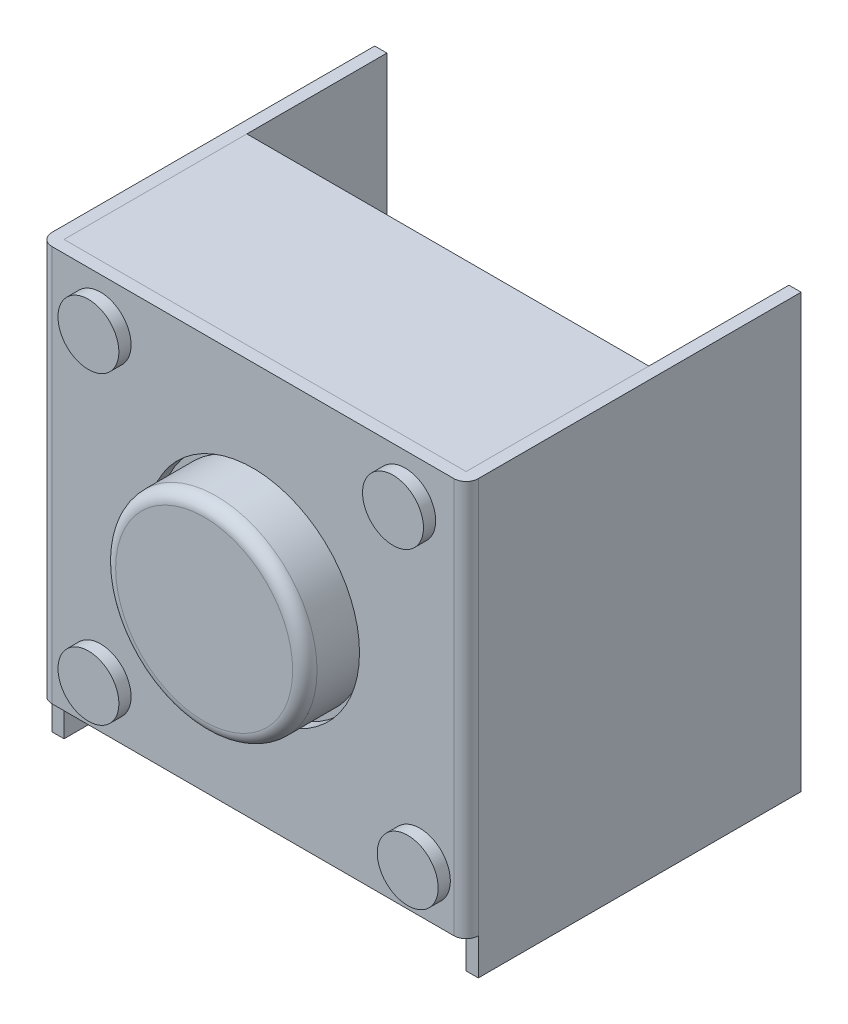
ISO-10303-21;
HEADER;
FILE_DESCRIPTION(('STEP AP214'),'2;1');
FILE_NAME('part.step','',(''),(''),'','','');
FILE_SCHEMA(('AUTOMOTIVE_DESIGN { 1 0 10303 214 1 1 1 1 }'));
ENDSEC;
DATA;
#1=APPLICATION_CONTEXT('core data for automotive mechanical design processes');
#2=APPLICATION_PROTOCOL_DEFINITION('international standard','automotive_design',2000,#1);
#3=PRODUCT_CONTEXT('',#1,'mechanical');
#4=PRODUCT('Part','Part','',(#3));
#5=PRODUCT_RELATED_PRODUCT_CATEGORY('part','',(#4));
#6=PRODUCT_DEFINITION_FORMATION('','',#4);
#7=PRODUCT_DEFINITION_CONTEXT('part definition',#1,'design');
#8=PRODUCT_DEFINITION('design','',#6,#7);
#9=PRODUCT_DEFINITION_SHAPE('','',#8);
#10=(LENGTH_UNIT() NAMED_UNIT(*) SI_UNIT(.MILLI.,.METRE.));
#11=(NAMED_UNIT(*) PLANE_ANGLE_UNIT() SI_UNIT($,.RADIAN.));
#12=(NAMED_UNIT(*) SI_UNIT($,.STERADIAN.) SOLID_ANGLE_UNIT());
#13=UNCERTAINTY_MEASURE_WITH_UNIT(LENGTH_MEASURE(1.E-05),#10,'distance_accuracy_value','');
#14=(GEOMETRIC_REPRESENTATION_CONTEXT(3) GLOBAL_UNCERTAINTY_ASSIGNED_CONTEXT((#13)) GLOBAL_UNIT_ASSIGNED_CONTEXT((#10,
#11,#12)) REPRESENTATION_CONTEXT('',''));
#15=CARTESIAN_POINT('',(0.,0.,0.));
#16=DIRECTION('',(0.,0.,1.));
#17=DIRECTION('',(1.,0.,0.));
#18=AXIS2_PLACEMENT_3D('',#15,#16,#17);
#19=CARTESIAN_POINT('',(2.74143456892354,-2.5,0.4));
#20=DIRECTION('',(0.,0.,-1.));
#21=DIRECTION('',(-1.,0.,0.));
#22=AXIS2_PLACEMENT_3D('',#19,#20,#21);
#23=CYLINDRICAL_SURFACE('',#22,0.5);
#24=CARTESIAN_POINT('',(2.74143456892354,-2.5,0.4));
#25=DIRECTION('',(0.,0.,1.));
#26=DIRECTION('',(1.,0.,0.));
#27=AXIS2_PLACEMENT_3D('',#24,#25,#26);
#28=CIRCLE('',#27,0.5);
#29=CARTESIAN_POINT('',(3.24143456892354,-2.5,0.4));
#30=VERTEX_POINT('',#29);
#31=EDGE_CURVE('E11',#30,#30,#28,.T.);
#32=ORIENTED_EDGE('',*,*,#31,.F.);
#33=EDGE_LOOP('',(#32));
#34=FACE_BOUND('',#33,.T.);
#35=CARTESIAN_POINT('',(2.74143456892354,-2.5,0.));
#36=DIRECTION('',(0.,0.,1.));
#37=DIRECTION('',(1.,0.,0.));
#38=AXIS2_PLACEMENT_3D('',#35,#36,#37);
#39=CIRCLE('',#38,0.5);
#40=CARTESIAN_POINT('',(3.24143456892354,-2.5,0.));
#41=VERTEX_POINT('',#40);
#42=EDGE_CURVE('E47',#41,#41,#39,.T.);
#43=ORIENTED_EDGE('',*,*,#42,.T.);
#44=EDGE_LOOP('',(#43));
#45=FACE_BOUND('',#44,.T.);
#46=ADVANCED_FACE('F44',(#34,#45),#23,.T.);
#47=CARTESIAN_POINT('',(2.74143456892354,-2.5,0.4));
#48=DIRECTION('',(0.,0.,1.));
#49=DIRECTION('',(1.,0.,0.));
#50=AXIS2_PLACEMENT_3D('',#47,#48,#49);
#51=PLANE('',#50);
#52=ORIENTED_EDGE('',*,*,#31,.T.);
#53=EDGE_LOOP('',(#52));
#54=FACE_BOUND('',#53,.T.);
#55=ADVANCED_FACE('F59',(#54),#51,.T.);
#56=CARTESIAN_POINT('',(2.74143456892354,-2.5,0.));
#57=DIRECTION('',(0.,0.,1.));
#58=DIRECTION('',(1.,0.,0.));
#59=AXIS2_PLACEMENT_3D('',#56,#57,#58);
#60=PLANE('',#59);
#61=ORIENTED_EDGE('',*,*,#42,.F.);
#62=EDGE_LOOP('',(#61));
#63=FACE_BOUND('',#62,.T.);
#64=ADVANCED_FACE('F57',(#63),#60,.F.);
#65=CLOSED_SHELL('',(#46,#55,#64));
#66=MANIFOLD_SOLID_BREP('B2',#65);
#67=CARTESIAN_POINT('',(-2.5,-2.5,0.4));
#68=DIRECTION('',(0.,0.,-1.));
#69=DIRECTION('',(-1.,0.,0.));
#70=AXIS2_PLACEMENT_3D('',#67,#68,#69);
#71=CYLINDRICAL_SURFACE('',#70,0.5);
#72=CARTESIAN_POINT('',(-2.5,-2.5,0.4));
#73=DIRECTION('',(0.,0.,1.));
#74=DIRECTION('',(1.,0.,0.));
#75=AXIS2_PLACEMENT_3D('',#72,#73,#74);
#76=CIRCLE('',#75,0.5);
#77=CARTESIAN_POINT('',(-2.,-2.5,0.4));
#78=VERTEX_POINT('',#77);
#79=EDGE_CURVE('E43',#78,#78,#76,.T.);
#80=ORIENTED_EDGE('',*,*,#79,.F.);
#81=EDGE_LOOP('',(#80));
#82=FACE_BOUND('',#81,.T.);
#83=CARTESIAN_POINT('',(-2.5,-2.5,0.));
#84=DIRECTION('',(0.,0.,1.));
#85=DIRECTION('',(1.,0.,0.));
#86=AXIS2_PLACEMENT_3D('',#83,#84,#85);
#87=CIRCLE('',#86,0.5);
#88=CARTESIAN_POINT('',(-2.,-2.5,0.));
#89=VERTEX_POINT('',#88);
#90=EDGE_CURVE('E96',#89,#89,#87,.T.);
#91=ORIENTED_EDGE('',*,*,#90,.T.);
#92=EDGE_LOOP('',(#91));
#93=FACE_BOUND('',#92,.T.);
#94=ADVANCED_FACE('F93',(#82,#93),#71,.T.);
#95=CARTESIAN_POINT('',(-2.5,-2.5,0.4));
#96=DIRECTION('',(0.,0.,1.));
#97=DIRECTION('',(1.,0.,0.));
#98=AXIS2_PLACEMENT_3D('',#95,#96,#97);
#99=PLANE('',#98);
#100=ORIENTED_EDGE('',*,*,#79,.T.);
#101=EDGE_LOOP('',(#100));
#102=FACE_BOUND('',#101,.T.);
#103=ADVANCED_FACE('F108',(#102),#99,.T.);
#104=CARTESIAN_POINT('',(-2.5,-2.5,0.));
#105=DIRECTION('',(0.,0.,1.));
#106=DIRECTION('',(1.,0.,0.));
#107=AXIS2_PLACEMENT_3D('',#104,#105,#106);
#108=PLANE('',#107);
#109=ORIENTED_EDGE('',*,*,#90,.F.);
#110=EDGE_LOOP('',(#109));
#111=FACE_BOUND('',#110,.T.);
#112=ADVANCED_FACE('F106',(#111),#108,.F.);
#113=CLOSED_SHELL('',(#94,#103,#112));
#114=MANIFOLD_SOLID_BREP('B6',#113);
#115=CARTESIAN_POINT('',(-2.5,2.5,0.4));
#116=DIRECTION('',(0.,0.,-1.));
#117=DIRECTION('',(-1.,0.,0.));
#118=AXIS2_PLACEMENT_3D('',#115,#116,#117);
#119=CYLINDRICAL_SURFACE('',#118,0.5);
#120=CARTESIAN_POINT('',(-2.5,2.5,0.4));
#121=DIRECTION('',(0.,0.,1.));
#122=DIRECTION('',(1.,0.,0.));
#123=AXIS2_PLACEMENT_3D('',#120,#121,#122);
#124=CIRCLE('',#123,0.5);
#125=CARTESIAN_POINT('',(-2.,2.5,0.4));
#126=VERTEX_POINT('',#125);
#127=EDGE_CURVE('E92',#126,#126,#124,.T.);
#128=ORIENTED_EDGE('',*,*,#127,.F.);
#129=EDGE_LOOP('',(#128));
#130=FACE_BOUND('',#129,.T.);
#131=CARTESIAN_POINT('',(-2.5,2.5,0.));
#132=DIRECTION('',(0.,0.,1.));
#133=DIRECTION('',(1.,0.,0.));
#134=AXIS2_PLACEMENT_3D('',#131,#132,#133);
#135=CIRCLE('',#134,0.5);
#136=CARTESIAN_POINT('',(-2.,2.5,0.));
#137=VERTEX_POINT('',#136);
#138=EDGE_CURVE('E145',#137,#137,#135,.T.);
#139=ORIENTED_EDGE('',*,*,#138,.T.);
#140=EDGE_LOOP('',(#139));
#141=FACE_BOUND('',#140,.T.);
#142=ADVANCED_FACE('F142',(#130,#141),#119,.T.);
#143=CARTESIAN_POINT('',(-2.5,2.5,0.4));
#144=DIRECTION('',(0.,0.,1.));
#145=DIRECTION('',(1.,0.,0.));
#146=AXIS2_PLACEMENT_3D('',#143,#144,#145);
#147=PLANE('',#146);
#148=ORIENTED_EDGE('',*,*,#127,.T.);
#149=EDGE_LOOP('',(#148));
#150=FACE_BOUND('',#149,.T.);
#151=ADVANCED_FACE('F157',(#150),#147,.T.);
#152=CARTESIAN_POINT('',(-2.5,2.5,0.));
#153=DIRECTION('',(0.,0.,1.));
#154=DIRECTION('',(1.,0.,0.));
#155=AXIS2_PLACEMENT_3D('',#152,#153,#154);
#156=PLANE('',#155);
#157=ORIENTED_EDGE('',*,*,#138,.F.);
#158=EDGE_LOOP('',(#157));
#159=FACE_BOUND('',#158,.T.);
#160=ADVANCED_FACE('F155',(#159),#156,.F.);
#161=CLOSED_SHELL('',(#142,#151,#160));
#162=MANIFOLD_SOLID_BREP('B38',#161);
#163=CARTESIAN_POINT('',(2.5,2.5,0.4));
#164=DIRECTION('',(0.,0.,-1.));
#165=DIRECTION('',(-1.,0.,0.));
#166=AXIS2_PLACEMENT_3D('',#163,#164,#165);
#167=CYLINDRICAL_SURFACE('',#166,0.5);
#168=CARTESIAN_POINT('',(2.5,2.5,0.4));
#169=DIRECTION('',(0.,0.,1.));
#170=DIRECTION('',(1.,0.,0.));
#171=AXIS2_PLACEMENT_3D('',#168,#169,#170);
#172=CIRCLE('',#171,0.5);
#173=CARTESIAN_POINT('',(3.,2.5,0.4));
#174=VERTEX_POINT('',#173);
#175=EDGE_CURVE('E141',#174,#174,#172,.T.);
#176=ORIENTED_EDGE('',*,*,#175,.F.);
#177=EDGE_LOOP('',(#176));
#178=FACE_BOUND('',#177,.T.);
#179=CARTESIAN_POINT('',(2.5,2.5,0.));
#180=DIRECTION('',(0.,0.,1.));
#181=DIRECTION('',(1.,0.,0.));
#182=AXIS2_PLACEMENT_3D('',#179,#180,#181);
#183=CIRCLE('',#182,0.5);
#184=CARTESIAN_POINT('',(3.,2.5,0.));
#185=VERTEX_POINT('',#184);
#186=EDGE_CURVE('E194',#185,#185,#183,.T.);
#187=ORIENTED_EDGE('',*,*,#186,.T.);
#188=EDGE_LOOP('',(#187));
#189=FACE_BOUND('',#188,.T.);
#190=ADVANCED_FACE('F191',(#178,#189),#167,.T.);
#191=CARTESIAN_POINT('',(2.5,2.5,0.4));
#192=DIRECTION('',(0.,0.,1.));
#193=DIRECTION('',(1.,0.,0.));
#194=AXIS2_PLACEMENT_3D('',#191,#192,#193);
#195=PLANE('',#194);
#196=ORIENTED_EDGE('',*,*,#175,.T.);
#197=EDGE_LOOP('',(#196));
#198=FACE_BOUND('',#197,.T.);
#199=ADVANCED_FACE('F206',(#198),#195,.T.);
#200=CARTESIAN_POINT('',(2.5,2.5,0.));
#201=DIRECTION('',(0.,0.,1.));
#202=DIRECTION('',(1.,0.,0.));
#203=AXIS2_PLACEMENT_3D('',#200,#201,#202);
#204=PLANE('',#203);
#205=ORIENTED_EDGE('',*,*,#186,.F.);
#206=EDGE_LOOP('',(#205));
#207=FACE_BOUND('',#206,.T.);
#208=ADVANCED_FACE('F204',(#207),#204,.F.);
#209=CLOSED_SHELL('',(#190,#199,#208));
#210=MANIFOLD_SOLID_BREP('B87',#209);
#211=CARTESIAN_POINT('',(0.,0.,1.));
#212=DIRECTION('',(0.,0.,-1.));
#213=DIRECTION('',(-1.,0.,0.));
#214=AXIS2_PLACEMENT_3D('',#211,#212,#213);
#215=CYLINDRICAL_SURFACE('',#214,1.65282338303741);
#216=CARTESIAN_POINT('',(0.,0.,0.8));
#217=DIRECTION('',(0.,0.,1.));
#218=DIRECTION('',(1.,0.,0.));
#219=AXIS2_PLACEMENT_3D('',#216,#217,#218);
#220=CIRCLE('',#219,1.65282338303741);
#221=CARTESIAN_POINT('',(1.65282338303741,0.,0.8));
#222=VERTEX_POINT('',#221);
#223=EDGE_CURVE('E190',#222,#222,#220,.F.);
#224=ORIENTED_EDGE('',*,*,#223,.T.);
#225=EDGE_LOOP('',(#224));
#226=FACE_BOUND('',#225,.T.);
#227=CARTESIAN_POINT('',(0.,0.,0.));
#228=DIRECTION('',(0.,0.,1.));
#229=DIRECTION('',(1.,0.,0.));
#230=AXIS2_PLACEMENT_3D('',#227,#228,#229);
#231=CIRCLE('',#230,1.65282338303741);
#232=CARTESIAN_POINT('',(1.65282338303741,0.,0.));
#233=VERTEX_POINT('',#232);
#234=EDGE_CURVE('E253',#233,#233,#231,.T.);
#235=ORIENTED_EDGE('',*,*,#234,.T.);
#236=EDGE_LOOP('',(#235));
#237=FACE_BOUND('',#236,.T.);
#238=ADVANCED_FACE('F242',(#226,#237),#215,.T.);
#239=CARTESIAN_POINT('',(0.,0.,1.));
#240=DIRECTION('',(0.,0.,1.));
#241=DIRECTION('',(1.,0.,0.));
#242=AXIS2_PLACEMENT_3D('',#239,#240,#241);
#243=PLANE('',#242);
#244=CARTESIAN_POINT('',(0.,0.,1.));
#245=DIRECTION('',(0.,0.,1.));
#246=DIRECTION('',(1.,0.,0.));
#247=AXIS2_PLACEMENT_3D('',#244,#245,#246);
#248=CIRCLE('',#247,1.45282338303741);
#249=CARTESIAN_POINT('',(1.45282338303741,0.,1.));
#250=VERTEX_POINT('',#249);
#251=EDGE_CURVE('E249',#250,#250,#248,.T.);
#252=ORIENTED_EDGE('',*,*,#251,.T.);
#253=EDGE_LOOP('',(#252));
#254=FACE_BOUND('',#253,.T.);
#255=ADVANCED_FACE('F263',(#254),#243,.T.);
#256=CARTESIAN_POINT('',(0.,0.,0.));
#257=DIRECTION('',(0.,0.,1.));
#258=DIRECTION('',(1.,0.,0.));
#259=AXIS2_PLACEMENT_3D('',#256,#257,#258);
#260=PLANE('',#259);
#261=ORIENTED_EDGE('',*,*,#234,.F.);
#262=EDGE_LOOP('',(#261));
#263=FACE_BOUND('',#262,.T.);
#264=ADVANCED_FACE('F261',(#263),#260,.F.);
#265=CARTESIAN_POINT('',(0.,0.,0.8));
#266=DIRECTION('',(0.,0.,1.));
#267=DIRECTION('',(1.,0.,0.));
#268=AXIS2_PLACEMENT_3D('',#265,#266,#267);
#269=TOROIDAL_SURFACE('',#268,1.45282338303741,0.2);
#270=ORIENTED_EDGE('',*,*,#223,.F.);
#271=EDGE_LOOP('',(#270));
#272=FACE_BOUND('',#271,.T.);
#273=ORIENTED_EDGE('',*,*,#251,.F.);
#274=EDGE_LOOP('',(#273));
#275=FACE_BOUND('',#274,.T.);
#276=ADVANCED_FACE('F244',(#272,#275),#269,.T.);
#277=CLOSED_SHELL('',(#238,#255,#264,#276));
#278=MANIFOLD_SOLID_BREP('B136',#277);
#279=CARTESIAN_POINT('',(3.3,3.25,-3.));
#280=DIRECTION('',(-1.,0.,0.));
#281=DIRECTION('',(0.,0.,1.));
#282=AXIS2_PLACEMENT_3D('',#279,#280,#281);
#283=PLANE('',#282);
#284=DIRECTION('',(0.,-1.,0.));
#285=VECTOR('',#284,1.);
#286=CARTESIAN_POINT('',(3.3,3.25,0.));
#287=LINE('',#286,#285);
#288=CARTESIAN_POINT('',(3.3,3.25,0.));
#289=VERTEX_POINT('',#288);
#290=CARTESIAN_POINT('',(3.3,-3.25,0.));
#291=VERTEX_POINT('',#290);
#292=EDGE_CURVE('E370',#289,#291,#287,.T.);
#293=ORIENTED_EDGE('',*,*,#292,.T.);
#294=DIRECTION('',(0.,0.,1.));
#295=VECTOR('',#294,1.);
#296=CARTESIAN_POINT('',(3.3,-3.25,-3.));
#297=LINE('',#296,#295);
#298=CARTESIAN_POINT('',(3.3,-3.25,-3.));
#299=VERTEX_POINT('',#298);
#300=EDGE_CURVE('E240',#299,#291,#297,.T.);
#301=ORIENTED_EDGE('',*,*,#300,.F.);
#302=DIRECTION('',(0.,-1.,0.));
#303=VECTOR('',#302,1.);
#304=CARTESIAN_POINT('',(3.3,3.25,-3.));
#305=LINE('',#304,#303);
#306=CARTESIAN_POINT('',(3.3,3.25,-3.));
#307=VERTEX_POINT('',#306);
#308=EDGE_CURVE('E358',#307,#299,#305,.T.);
#309=ORIENTED_EDGE('',*,*,#308,.F.);
#310=DIRECTION('',(0.,0.,1.));
#311=VECTOR('',#310,1.);
#312=CARTESIAN_POINT('',(3.3,3.25,-3.));
#313=LINE('',#312,#311);
#314=EDGE_CURVE('E366',#307,#289,#313,.T.);
#315=ORIENTED_EDGE('',*,*,#314,.T.);
#316=EDGE_LOOP('',(#293,#301,#309,#315));
#317=FACE_BOUND('',#316,.T.);
#318=ADVANCED_FACE('F307',(#317),#283,.F.);
#319=CARTESIAN_POINT('',(3.3,-3.25,-3.));
#320=DIRECTION('',(0.,1.,0.));
#321=DIRECTION('',(0.,0.,1.));
#322=AXIS2_PLACEMENT_3D('',#319,#320,#321);
#323=PLANE('',#322);
#324=DIRECTION('',(-1.,0.,0.));
#325=VECTOR('',#324,1.);
#326=CARTESIAN_POINT('',(3.3,-3.25,0.));
#327=LINE('',#326,#325);
#328=CARTESIAN_POINT('',(-3.3,-3.25,0.));
#329=VERTEX_POINT('',#328);
#330=EDGE_CURVE('E362',#291,#329,#327,.T.);
#331=ORIENTED_EDGE('',*,*,#330,.T.);
#332=DIRECTION('',(0.,0.,1.));
#333=VECTOR('',#332,1.);
#334=CARTESIAN_POINT('',(-3.3,-3.25,-3.));
#335=LINE('',#334,#333);
#336=CARTESIAN_POINT('',(-3.3,-3.25,-3.));
#337=VERTEX_POINT('',#336);
#338=EDGE_CURVE('E315',#337,#329,#335,.T.);
#339=ORIENTED_EDGE('',*,*,#338,.F.);
#340=DIRECTION('',(-1.,0.,0.));
#341=VECTOR('',#340,1.);
#342=CARTESIAN_POINT('',(3.3,-3.25,-3.));
#343=LINE('',#342,#341);
#344=EDGE_CURVE('E353',#299,#337,#343,.T.);
#345=ORIENTED_EDGE('',*,*,#344,.F.);
#346=ORIENTED_EDGE('',*,*,#300,.T.);
#347=EDGE_LOOP('',(#331,#339,#345,#346));
#348=FACE_BOUND('',#347,.T.);
#349=ADVANCED_FACE('F361',(#348),#323,.F.);
#350=CARTESIAN_POINT('',(-3.3,3.25,-3.));
#351=DIRECTION('',(1.,0.,0.));
#352=DIRECTION('',(0.,1.,0.));
#353=AXIS2_PLACEMENT_3D('',#350,#351,#352);
#354=PLANE('',#353);
#355=DIRECTION('',(0.,1.,0.));
#356=VECTOR('',#355,1.);
#357=CARTESIAN_POINT('',(-3.3,3.25,0.));
#358=LINE('',#357,#356);
#359=CARTESIAN_POINT('',(-3.3,3.25,0.));
#360=VERTEX_POINT('',#359);
#361=EDGE_CURVE('E340',#329,#360,#358,.T.);
#362=ORIENTED_EDGE('',*,*,#361,.T.);
#363=DIRECTION('',(0.,0.,1.));
#364=VECTOR('',#363,1.);
#365=CARTESIAN_POINT('',(-3.3,3.25,-3.));
#366=LINE('',#365,#364);
#367=CARTESIAN_POINT('',(-3.3,3.25,-3.));
#368=VERTEX_POINT('',#367);
#369=EDGE_CURVE('E363',#368,#360,#366,.T.);
#370=ORIENTED_EDGE('',*,*,#369,.F.);
#371=DIRECTION('',(0.,1.,0.));
#372=VECTOR('',#371,1.);
#373=CARTESIAN_POINT('',(-3.3,3.25,-3.));
#374=LINE('',#373,#372);
#375=EDGE_CURVE('E356',#337,#368,#374,.T.);
#376=ORIENTED_EDGE('',*,*,#375,.F.);
#377=ORIENTED_EDGE('',*,*,#338,.T.);
#378=EDGE_LOOP('',(#362,#370,#376,#377));
#379=FACE_BOUND('',#378,.T.);
#380=ADVANCED_FACE('F364',(#379),#354,.F.);
#381=CARTESIAN_POINT('',(3.3,3.25,-3.));
#382=DIRECTION('',(0.,-1.,0.));
#383=DIRECTION('',(0.,0.,-1.));
#384=AXIS2_PLACEMENT_3D('',#381,#382,#383);
#385=PLANE('',#384);
#386=DIRECTION('',(1.,0.,0.));
#387=VECTOR('',#386,1.);
#388=CARTESIAN_POINT('',(3.3,3.25,0.));
#389=LINE('',#388,#387);
#390=EDGE_CURVE('E346',#360,#289,#389,.T.);
#391=ORIENTED_EDGE('',*,*,#390,.T.);
#392=ORIENTED_EDGE('',*,*,#314,.F.);
#393=DIRECTION('',(1.,0.,0.));
#394=VECTOR('',#393,1.);
#395=CARTESIAN_POINT('',(3.3,3.25,-3.));
#396=LINE('',#395,#394);
#397=EDGE_CURVE('E323',#368,#307,#396,.T.);
#398=ORIENTED_EDGE('',*,*,#397,.F.);
#399=ORIENTED_EDGE('',*,*,#369,.T.);
#400=EDGE_LOOP('',(#391,#392,#398,#399));
#401=FACE_BOUND('',#400,.T.);
#402=ADVANCED_FACE('F377',(#401),#385,.F.);
#403=CARTESIAN_POINT('',(3.3,-3.25,-3.));
#404=DIRECTION('',(0.,0.,-1.));
#405=DIRECTION('',(-1.,0.,0.));
#406=AXIS2_PLACEMENT_3D('',#403,#404,#405);
#407=PLANE('',#406);
#408=ORIENTED_EDGE('',*,*,#308,.T.);
#409=ORIENTED_EDGE('',*,*,#344,.T.);
#410=ORIENTED_EDGE('',*,*,#375,.T.);
#411=ORIENTED_EDGE('',*,*,#397,.T.);
#412=EDGE_LOOP('',(#408,#409,#410,#411));
#413=FACE_BOUND('',#412,.T.);
#414=ADVANCED_FACE('F354',(#413),#407,.T.);
#415=CARTESIAN_POINT('',(3.3,-3.25,0.));
#416=DIRECTION('',(0.,0.,-1.));
#417=DIRECTION('',(-1.,0.,0.));
#418=AXIS2_PLACEMENT_3D('',#415,#416,#417);
#419=PLANE('',#418);
#420=ORIENTED_EDGE('',*,*,#292,.F.);
#421=ORIENTED_EDGE('',*,*,#390,.F.);
#422=ORIENTED_EDGE('',*,*,#361,.F.);
#423=ORIENTED_EDGE('',*,*,#330,.F.);
#424=EDGE_LOOP('',(#420,#421,#422,#423));
#425=FACE_BOUND('',#424,.T.);
#426=ADVANCED_FACE('F380',(#425),#419,.F.);
#427=CLOSED_SHELL('',(#318,#349,#380,#402,#414,#426));
#428=MANIFOLD_SOLID_BREP('B185',#427);
#429=CARTESIAN_POINT('',(-3.5,3.25,0.2));
#430=DIRECTION('',(0.,0.,1.));
#431=DIRECTION('',(1.,0.,0.));
#432=AXIS2_PLACEMENT_3D('',#429,#430,#431);
#433=PLANE('',#432);
#434=DIRECTION('',(-1.,0.,0.));
#435=VECTOR('',#434,1.);
#436=CARTESIAN_POINT('',(-3.5,3.25,0.2));
#437=LINE('',#436,#435);
#438=CARTESIAN_POINT('',(3.3,3.25,0.2));
#439=VERTEX_POINT('',#438);
#440=CARTESIAN_POINT('',(-3.3,3.25,0.2));
#441=VERTEX_POINT('',#440);
#442=EDGE_CURVE('E628',#439,#441,#437,.T.);
#443=ORIENTED_EDGE('',*,*,#442,.T.);
#444=DIRECTION('',(0.,-1.,0.));
#445=VECTOR('',#444,1.);
#446=CARTESIAN_POINT('',(-3.3,-3.25,0.2));
#447=LINE('',#446,#445);
#448=CARTESIAN_POINT('',(-3.3,-3.25,0.2));
#449=VERTEX_POINT('',#448);
#450=EDGE_CURVE('E642',#441,#449,#447,.T.);
#451=ORIENTED_EDGE('',*,*,#450,.T.);
#452=DIRECTION('',(1.,0.,0.));
#453=VECTOR('',#452,1.);
#454=CARTESIAN_POINT('',(-3.5,-3.25,0.2));
#455=LINE('',#454,#453);
#456=CARTESIAN_POINT('',(3.3,-3.25,0.2));
#457=VERTEX_POINT('',#456);
#458=EDGE_CURVE('E625',#449,#457,#455,.T.);
#459=ORIENTED_EDGE('',*,*,#458,.T.);
#460=DIRECTION('',(0.,1.,0.));
#461=VECTOR('',#460,1.);
#462=CARTESIAN_POINT('',(3.3,3.25,0.2));
#463=LINE('',#462,#461);
#464=EDGE_CURVE('E639',#457,#439,#463,.T.);
#465=ORIENTED_EDGE('',*,*,#464,.T.);
#466=EDGE_LOOP('',(#443,#451,#459,#465));
#467=FACE_BOUND('',#466,.T.);
#468=CARTESIAN_POINT('',(-2.5,-2.5,0.2));
#469=DIRECTION('',(0.,0.,1.));
#470=DIRECTION('',(1.,0.,0.));
#471=AXIS2_PLACEMENT_3D('',#468,#469,#470);
#472=CIRCLE('',#471,0.5);
#473=CARTESIAN_POINT('',(-2.,-2.5,0.2));
#474=VERTEX_POINT('',#473);
#475=EDGE_CURVE('E601',#474,#474,#472,.T.);
#476=ORIENTED_EDGE('',*,*,#475,.F.);
#477=EDGE_LOOP('',(#476));
#478=FACE_BOUND('',#477,.T.);
#479=CARTESIAN_POINT('',(2.5,2.5,0.2));
#480=DIRECTION('',(0.,0.,1.));
#481=DIRECTION('',(1.,0.,0.));
#482=AXIS2_PLACEMENT_3D('',#479,#480,#481);
#483=CIRCLE('',#482,0.5);
#484=CARTESIAN_POINT('',(3.,2.5,0.2));
#485=VERTEX_POINT('',#484);
#486=EDGE_CURVE('E613',#485,#485,#483,.T.);
#487=ORIENTED_EDGE('',*,*,#486,.F.);
#488=EDGE_LOOP('',(#487));
#489=FACE_BOUND('',#488,.T.);
#490=CARTESIAN_POINT('',(0.,0.,0.2));
#491=DIRECTION('',(0.,0.,1.));
#492=DIRECTION('',(1.,0.,0.));
#493=AXIS2_PLACEMENT_3D('',#490,#491,#492);
#494=CIRCLE('',#493,1.75);
#495=CARTESIAN_POINT('',(1.75,0.,0.2));
#496=VERTEX_POINT('',#495);
#497=EDGE_CURVE('E619',#496,#496,#494,.T.);
#498=ORIENTED_EDGE('',*,*,#497,.F.);
#499=EDGE_LOOP('',(#498));
#500=FACE_BOUND('',#499,.T.);
#501=CARTESIAN_POINT('',(2.74143456892354,-2.5,0.2));
#502=DIRECTION('',(0.,0.,1.));
#503=DIRECTION('',(1.,0.,0.));
#504=AXIS2_PLACEMENT_3D('',#501,#502,#503);
#505=CIRCLE('',#504,0.5);
#506=CARTESIAN_POINT('',(3.24143456892354,-2.5,0.2));
#507=VERTEX_POINT('',#506);
#508=EDGE_CURVE('E607',#507,#507,#505,.T.);
#509=ORIENTED_EDGE('',*,*,#508,.F.);
#510=EDGE_LOOP('',(#509));
#511=FACE_BOUND('',#510,.T.);
#512=CARTESIAN_POINT('',(-2.5,2.5,0.2));
#513=DIRECTION('',(0.,0.,1.));
#514=DIRECTION('',(1.,0.,0.));
#515=AXIS2_PLACEMENT_3D('',#512,#513,#514);
#516=CIRCLE('',#515,0.5);
#517=CARTESIAN_POINT('',(-2.,2.5,0.2));
#518=VERTEX_POINT('',#517);
#519=EDGE_CURVE('E595',#518,#518,#516,.T.);
#520=ORIENTED_EDGE('',*,*,#519,.F.);
#521=EDGE_LOOP('',(#520));
#522=FACE_BOUND('',#521,.T.);
#523=ADVANCED_FACE('F431',(#467,#478,#489,#500,#511,#522),#433,.T.);
#524=CARTESIAN_POINT('',(-3.5,3.25,0.));
#525=DIRECTION('',(0.,0.,1.));
#526=DIRECTION('',(1.,0.,0.));
#527=AXIS2_PLACEMENT_3D('',#524,#525,#526);
#528=PLANE('',#527);
#529=CARTESIAN_POINT('',(-2.5,-2.5,0.));
#530=DIRECTION('',(0.,0.,1.));
#531=DIRECTION('',(1.,0.,0.));
#532=AXIS2_PLACEMENT_3D('',#529,#530,#531);
#533=CIRCLE('',#532,0.5);
#534=CARTESIAN_POINT('',(-2.,-2.5,0.));
#535=VERTEX_POINT('',#534);
#536=EDGE_CURVE('E598',#535,#535,#533,.T.);
#537=ORIENTED_EDGE('',*,*,#536,.T.);
#538=EDGE_LOOP('',(#537));
#539=FACE_BOUND('',#538,.T.);
#540=CARTESIAN_POINT('',(2.5,2.5,0.));
#541=DIRECTION('',(0.,0.,1.));
#542=DIRECTION('',(1.,0.,0.));
#543=AXIS2_PLACEMENT_3D('',#540,#541,#542);
#544=CIRCLE('',#543,0.5);
#545=CARTESIAN_POINT('',(3.,2.5,0.));
#546=VERTEX_POINT('',#545);
#547=EDGE_CURVE('E610',#546,#546,#544,.T.);
#548=ORIENTED_EDGE('',*,*,#547,.T.);
#549=EDGE_LOOP('',(#548));
#550=FACE_BOUND('',#549,.T.);
#551=DIRECTION('',(1.,0.,0.));
#552=VECTOR('',#551,1.);
#553=CARTESIAN_POINT('',(-3.5,-3.25,0.));
#554=LINE('',#553,#552);
#555=CARTESIAN_POINT('',(-3.3,-3.25,0.));
#556=VERTEX_POINT('',#555);
#557=CARTESIAN_POINT('',(3.3,-3.25,0.));
#558=VERTEX_POINT('',#557);
#559=EDGE_CURVE('E622',#556,#558,#554,.T.);
#560=ORIENTED_EDGE('',*,*,#559,.F.);
#561=DIRECTION('',(0.,1.,0.));
#562=VECTOR('',#561,1.);
#563=CARTESIAN_POINT('',(-3.3,3.25,0.));
#564=LINE('',#563,#562);
#565=CARTESIAN_POINT('',(-3.3,3.25,0.));
#566=VERTEX_POINT('',#565);
#567=EDGE_CURVE('E558',#556,#566,#564,.T.);
#568=ORIENTED_EDGE('',*,*,#567,.T.);
#569=DIRECTION('',(-1.,0.,0.));
#570=VECTOR('',#569,1.);
#571=CARTESIAN_POINT('',(-3.5,3.25,0.));
#572=LINE('',#571,#570);
#573=CARTESIAN_POINT('',(3.3,3.25,0.));
#574=VERTEX_POINT('',#573);
#575=EDGE_CURVE('E545',#574,#566,#572,.T.);
#576=ORIENTED_EDGE('',*,*,#575,.F.);
#577=DIRECTION('',(0.,-1.,0.));
#578=VECTOR('',#577,1.);
#579=CARTESIAN_POINT('',(3.3,3.25,0.));
#580=LINE('',#579,#578);
#581=EDGE_CURVE('E585',#574,#558,#580,.T.);
#582=ORIENTED_EDGE('',*,*,#581,.T.);
#583=EDGE_LOOP('',(#560,#568,#576,#582));
#584=FACE_BOUND('',#583,.T.);
#585=CARTESIAN_POINT('',(0.,0.,0.));
#586=DIRECTION('',(0.,0.,1.));
#587=DIRECTION('',(1.,0.,0.));
#588=AXIS2_PLACEMENT_3D('',#585,#586,#587);
#589=CIRCLE('',#588,1.75);
#590=CARTESIAN_POINT('',(1.75,0.,0.));
#591=VERTEX_POINT('',#590);
#592=EDGE_CURVE('E616',#591,#591,#589,.T.);
#593=ORIENTED_EDGE('',*,*,#592,.T.);
#594=EDGE_LOOP('',(#593));
#595=FACE_BOUND('',#594,.T.);
#596=CARTESIAN_POINT('',(2.74143456892354,-2.5,0.));
#597=DIRECTION('',(0.,0.,1.));
#598=DIRECTION('',(1.,0.,0.));
#599=AXIS2_PLACEMENT_3D('',#596,#597,#598);
#600=CIRCLE('',#599,0.5);
#601=CARTESIAN_POINT('',(3.24143456892354,-2.5,0.));
#602=VERTEX_POINT('',#601);
#603=EDGE_CURVE('E604',#602,#602,#600,.T.);
#604=ORIENTED_EDGE('',*,*,#603,.T.);
#605=EDGE_LOOP('',(#604));
#606=FACE_BOUND('',#605,.T.);
#607=CARTESIAN_POINT('',(-2.5,2.5,0.));
#608=DIRECTION('',(0.,0.,1.));
#609=DIRECTION('',(1.,0.,0.));
#610=AXIS2_PLACEMENT_3D('',#607,#608,#609);
#611=CIRCLE('',#610,0.5);
#612=CARTESIAN_POINT('',(-2.,2.5,0.));
#613=VERTEX_POINT('',#612);
#614=EDGE_CURVE('E594',#613,#613,#611,.T.);
#615=ORIENTED_EDGE('',*,*,#614,.T.);
#616=EDGE_LOOP('',(#615));
#617=FACE_BOUND('',#616,.T.);
#618=ADVANCED_FACE('F677',(#539,#550,#584,#595,#606,#617),#528,.F.);
#619=CARTESIAN_POINT('',(-3.5,3.25,0.2));
#620=DIRECTION('',(1.,0.,0.));
#621=DIRECTION('',(0.,1.,0.));
#622=AXIS2_PLACEMENT_3D('',#619,#620,#621);
#623=PLANE('',#622);
#624=DIRECTION('',(0.,-1.,0.));
#625=VECTOR('',#624,1.);
#626=CARTESIAN_POINT('',(-3.5,-3.85,0.));
#627=LINE('',#626,#625);
#628=CARTESIAN_POINT('',(-3.5,-3.25,0.));
#629=VERTEX_POINT('',#628);
#630=CARTESIAN_POINT('',(-3.5,-3.85,0.));
#631=VERTEX_POINT('',#630);
#632=EDGE_CURVE('E546',#629,#631,#627,.T.);
#633=ORIENTED_EDGE('',*,*,#632,.F.);
#634=DIRECTION('',(0.,-1.,0.));
#635=VECTOR('',#634,1.);
#636=CARTESIAN_POINT('',(-3.5,3.25,0.));
#637=LINE('',#636,#635);
#638=CARTESIAN_POINT('',(-3.5,3.25,0.));
#639=VERTEX_POINT('',#638);
#640=EDGE_CURVE('E454',#629,#639,#637,.F.);
#641=ORIENTED_EDGE('',*,*,#640,.T.);
#642=DIRECTION('',(0.,0.,-1.));
#643=VECTOR('',#642,1.);
#644=CARTESIAN_POINT('',(-3.5,3.25,0.2));
#645=LINE('',#644,#643);
#646=CARTESIAN_POINT('',(-3.5,3.25,-5.3));
#647=VERTEX_POINT('',#646);
#648=EDGE_CURVE('E631',#639,#647,#645,.T.);
#649=ORIENTED_EDGE('',*,*,#648,.T.);
#650=DIRECTION('',(0.,1.,0.));
#651=VECTOR('',#650,1.);
#652=CARTESIAN_POINT('',(-3.5,3.25,-5.3));
#653=LINE('',#652,#651);
#654=CARTESIAN_POINT('',(-3.5,-3.85,-5.3));
#655=VERTEX_POINT('',#654);
#656=EDGE_CURVE('E537',#655,#647,#653,.T.);
#657=ORIENTED_EDGE('',*,*,#656,.F.);
#658=DIRECTION('',(0.,0.,-1.));
#659=VECTOR('',#658,1.);
#660=CARTESIAN_POINT('',(-3.5,-3.85,-5.3));
#661=LINE('',#660,#659);
#662=EDGE_CURVE('E548',#631,#655,#661,.T.);
#663=ORIENTED_EDGE('',*,*,#662,.F.);
#664=EDGE_LOOP('',(#633,#641,#649,#657,#663));
#665=FACE_BOUND('',#664,.T.);
#666=ADVANCED_FACE('F665',(#665),#623,.F.);
#667=CARTESIAN_POINT('',(-3.5,-3.25,0.2));
#668=DIRECTION('',(0.,1.,0.));
#669=DIRECTION('',(0.,0.,1.));
#670=AXIS2_PLACEMENT_3D('',#667,#668,#669);
#671=PLANE('',#670);
#672=ORIENTED_EDGE('',*,*,#458,.F.);
#673=CARTESIAN_POINT('',(-3.3,-3.25,0.));
#674=DIRECTION('',(0.,1.,0.));
#675=DIRECTION('',(0.,0.,1.));
#676=AXIS2_PLACEMENT_3D('',#673,#674,#675);
#677=CIRCLE('',#676,0.2);
#678=EDGE_CURVE('E647',#449,#629,#677,.F.);
#679=ORIENTED_EDGE('',*,*,#678,.T.);
#680=EDGE_CURVE('E632',#629,#556,#554,.T.);
#681=ORIENTED_EDGE('',*,*,#680,.T.);
#682=ORIENTED_EDGE('',*,*,#559,.T.);
#683=DIRECTION('',(1.,0.,0.));
#684=VECTOR('',#683,1.);
#685=CARTESIAN_POINT('',(3.3,-3.25,0.));
#686=LINE('',#685,#684);
#687=CARTESIAN_POINT('',(3.5,-3.25,0.));
#688=VERTEX_POINT('',#687);
#689=EDGE_CURVE('E574',#558,#688,#686,.T.);
#690=ORIENTED_EDGE('',*,*,#689,.T.);
#691=CARTESIAN_POINT('',(3.3,-3.25,0.));
#692=DIRECTION('',(0.,1.,0.));
#693=DIRECTION('',(0.,0.,1.));
#694=AXIS2_PLACEMENT_3D('',#691,#692,#693);
#695=CIRCLE('',#694,0.2);
#696=EDGE_CURVE('E645',#688,#457,#695,.F.);
#697=ORIENTED_EDGE('',*,*,#696,.T.);
#698=EDGE_LOOP('',(#672,#679,#681,#682,#690,#697));
#699=FACE_BOUND('',#698,.T.);
#700=ADVANCED_FACE('F660',(#699),#671,.F.);
#701=CARTESIAN_POINT('',(3.5,3.25,0.2));
#702=DIRECTION('',(-1.,0.,0.));
#703=DIRECTION('',(0.,-1.,0.));
#704=AXIS2_PLACEMENT_3D('',#701,#702,#703);
#705=PLANE('',#704);
#706=DIRECTION('',(0.,0.,-1.));
#707=VECTOR('',#706,1.);
#708=CARTESIAN_POINT('',(3.5,3.25,0.2));
#709=LINE('',#708,#707);
#710=CARTESIAN_POINT('',(3.5,3.25,0.));
#711=VERTEX_POINT('',#710);
#712=CARTESIAN_POINT('',(3.5,3.25,-5.3));
#713=VERTEX_POINT('',#712);
#714=EDGE_CURVE('E637',#711,#713,#709,.T.);
#715=ORIENTED_EDGE('',*,*,#714,.F.);
#716=DIRECTION('',(0.,1.,0.));
#717=VECTOR('',#716,1.);
#718=CARTESIAN_POINT('',(3.5,-3.25,0.));
#719=LINE('',#718,#717);
#720=EDGE_CURVE('E305',#711,#688,#719,.F.);
#721=ORIENTED_EDGE('',*,*,#720,.T.);
#722=DIRECTION('',(0.,-1.,0.));
#723=VECTOR('',#722,1.);
#724=CARTESIAN_POINT('',(3.5,-3.85,0.));
#725=LINE('',#724,#723);
#726=CARTESIAN_POINT('',(3.5,-3.85,0.));
#727=VERTEX_POINT('',#726);
#728=EDGE_CURVE('E561',#688,#727,#725,.T.);
#729=ORIENTED_EDGE('',*,*,#728,.T.);
#730=DIRECTION('',(0.,0.,-1.));
#731=VECTOR('',#730,1.);
#732=CARTESIAN_POINT('',(3.5,-3.85,-5.3));
#733=LINE('',#732,#731);
#734=CARTESIAN_POINT('',(3.5,-3.85,-5.3));
#735=VERTEX_POINT('',#734);
#736=EDGE_CURVE('E577',#727,#735,#733,.T.);
#737=ORIENTED_EDGE('',*,*,#736,.T.);
#738=DIRECTION('',(0.,1.,0.));
#739=VECTOR('',#738,1.);
#740=CARTESIAN_POINT('',(3.5,3.25,-5.3));
#741=LINE('',#740,#739);
#742=EDGE_CURVE('E566',#735,#713,#741,.T.);
#743=ORIENTED_EDGE('',*,*,#742,.T.);
#744=EDGE_LOOP('',(#715,#721,#729,#737,#743));
#745=FACE_BOUND('',#744,.T.);
#746=ADVANCED_FACE('F690',(#745),#705,.F.);
#747=CARTESIAN_POINT('',(-3.5,3.25,0.2));
#748=DIRECTION('',(0.,-1.,0.));
#749=DIRECTION('',(1.,0.,0.));
#750=AXIS2_PLACEMENT_3D('',#747,#748,#749);
#751=PLANE('',#750);
#752=ORIENTED_EDGE('',*,*,#648,.F.);
#753=CARTESIAN_POINT('',(-3.3,3.25,0.));
#754=DIRECTION('',(0.,-1.,0.));
#755=DIRECTION('',(1.,0.,0.));
#756=AXIS2_PLACEMENT_3D('',#753,#754,#755);
#757=CIRCLE('',#756,0.2);
#758=EDGE_CURVE('E439',#639,#441,#757,.F.);
#759=ORIENTED_EDGE('',*,*,#758,.T.);
#760=ORIENTED_EDGE('',*,*,#442,.F.);
#761=CARTESIAN_POINT('',(3.3,3.25,0.));
#762=DIRECTION('',(0.,-1.,0.));
#763=DIRECTION('',(1.,0.,0.));
#764=AXIS2_PLACEMENT_3D('',#761,#762,#763);
#765=CIRCLE('',#764,0.2);
#766=EDGE_CURVE('E446',#439,#711,#765,.F.);
#767=ORIENTED_EDGE('',*,*,#766,.T.);
#768=ORIENTED_EDGE('',*,*,#714,.T.);
#769=DIRECTION('',(1.,0.,0.));
#770=VECTOR('',#769,1.);
#771=CARTESIAN_POINT('',(3.3,3.25,-5.3));
#772=LINE('',#771,#770);
#773=CARTESIAN_POINT('',(3.3,3.25,-5.3));
#774=VERTEX_POINT('',#773);
#775=EDGE_CURVE('E582',#774,#713,#772,.T.);
#776=ORIENTED_EDGE('',*,*,#775,.F.);
#777=DIRECTION('',(0.,0.,1.));
#778=VECTOR('',#777,1.);
#779=CARTESIAN_POINT('',(3.3,3.25,0.2));
#780=LINE('',#779,#778);
#781=EDGE_CURVE('E572',#774,#574,#780,.T.);
#782=ORIENTED_EDGE('',*,*,#781,.T.);
#783=ORIENTED_EDGE('',*,*,#575,.T.);
#784=DIRECTION('',(0.,0.,1.));
#785=VECTOR('',#784,1.);
#786=CARTESIAN_POINT('',(-3.3,3.25,0.2));
#787=LINE('',#786,#785);
#788=CARTESIAN_POINT('',(-3.3,3.25,-5.3));
#789=VERTEX_POINT('',#788);
#790=EDGE_CURVE('E524',#789,#566,#787,.T.);
#791=ORIENTED_EDGE('',*,*,#790,.F.);
#792=DIRECTION('',(-1.,0.,0.));
#793=VECTOR('',#792,1.);
#794=CARTESIAN_POINT('',(-3.3,3.25,-5.3));
#795=LINE('',#794,#793);
#796=EDGE_CURVE('E534',#789,#647,#795,.T.);
#797=ORIENTED_EDGE('',*,*,#796,.T.);
#798=EDGE_LOOP('',(#752,#759,#760,#767,#768,#776,#782,#783,#791,#797));
#799=FACE_BOUND('',#798,.T.);
#800=ADVANCED_FACE('F542',(#799),#751,.F.);
#801=CARTESIAN_POINT('',(0.,0.,0.2));
#802=DIRECTION('',(0.,0.,-1.));
#803=DIRECTION('',(-1.,0.,0.));
#804=AXIS2_PLACEMENT_3D('',#801,#802,#803);
#805=CYLINDRICAL_SURFACE('',#804,1.75);
#806=ORIENTED_EDGE('',*,*,#497,.T.);
#807=EDGE_LOOP('',(#806));
#808=FACE_BOUND('',#807,.T.);
#809=ORIENTED_EDGE('',*,*,#592,.F.);
#810=EDGE_LOOP('',(#809));
#811=FACE_BOUND('',#810,.T.);
#812=ADVANCED_FACE('F685',(#808,#811),#805,.F.);
#813=CARTESIAN_POINT('',(2.5,2.5,0.2));
#814=DIRECTION('',(0.,0.,-1.));
#815=DIRECTION('',(-1.,0.,0.));
#816=AXIS2_PLACEMENT_3D('',#813,#814,#815);
#817=CYLINDRICAL_SURFACE('',#816,0.5);
#818=ORIENTED_EDGE('',*,*,#486,.T.);
#819=EDGE_LOOP('',(#818));
#820=FACE_BOUND('',#819,.T.);
#821=ORIENTED_EDGE('',*,*,#547,.F.);
#822=EDGE_LOOP('',(#821));
#823=FACE_BOUND('',#822,.T.);
#824=ADVANCED_FACE('F743',(#820,#823),#817,.F.);
#825=CARTESIAN_POINT('',(2.74143456892354,-2.5,0.2));
#826=DIRECTION('',(0.,0.,-1.));
#827=DIRECTION('',(-1.,0.,0.));
#828=AXIS2_PLACEMENT_3D('',#825,#826,#827);
#829=CYLINDRICAL_SURFACE('',#828,0.5);
#830=ORIENTED_EDGE('',*,*,#508,.T.);
#831=EDGE_LOOP('',(#830));
#832=FACE_BOUND('',#831,.T.);
#833=ORIENTED_EDGE('',*,*,#603,.F.);
#834=EDGE_LOOP('',(#833));
#835=FACE_BOUND('',#834,.T.);
#836=ADVANCED_FACE('F736',(#832,#835),#829,.F.);
#837=CARTESIAN_POINT('',(-2.5,-2.5,0.2));
#838=DIRECTION('',(0.,0.,-1.));
#839=DIRECTION('',(-1.,0.,0.));
#840=AXIS2_PLACEMENT_3D('',#837,#838,#839);
#841=CYLINDRICAL_SURFACE('',#840,0.5);
#842=ORIENTED_EDGE('',*,*,#475,.T.);
#843=EDGE_LOOP('',(#842));
#844=FACE_BOUND('',#843,.T.);
#845=ORIENTED_EDGE('',*,*,#536,.F.);
#846=EDGE_LOOP('',(#845));
#847=FACE_BOUND('',#846,.T.);
#848=ADVANCED_FACE('F727',(#844,#847),#841,.F.);
#849=CARTESIAN_POINT('',(-2.5,2.5,0.2));
#850=DIRECTION('',(0.,0.,-1.));
#851=DIRECTION('',(-1.,0.,0.));
#852=AXIS2_PLACEMENT_3D('',#849,#850,#851);
#853=CYLINDRICAL_SURFACE('',#852,0.5);
#854=ORIENTED_EDGE('',*,*,#519,.T.);
#855=EDGE_LOOP('',(#854));
#856=FACE_BOUND('',#855,.T.);
#857=ORIENTED_EDGE('',*,*,#614,.F.);
#858=EDGE_LOOP('',(#857));
#859=FACE_BOUND('',#858,.T.);
#860=ADVANCED_FACE('F725',(#856,#859),#853,.F.);
#861=CARTESIAN_POINT('',(3.3,3.25,0.2));
#862=DIRECTION('',(-1.,0.,0.));
#863=DIRECTION('',(0.,-1.,0.));
#864=AXIS2_PLACEMENT_3D('',#861,#862,#863);
#865=PLANE('',#864);
#866=ORIENTED_EDGE('',*,*,#581,.F.);
#867=ORIENTED_EDGE('',*,*,#781,.F.);
#868=DIRECTION('',(0.,1.,0.));
#869=VECTOR('',#868,1.);
#870=CARTESIAN_POINT('',(3.3,3.25,-5.3));
#871=LINE('',#870,#869);
#872=CARTESIAN_POINT('',(3.3,-3.85,-5.3));
#873=VERTEX_POINT('',#872);
#874=EDGE_CURVE('E569',#873,#774,#871,.T.);
#875=ORIENTED_EDGE('',*,*,#874,.F.);
#876=DIRECTION('',(0.,0.,-1.));
#877=VECTOR('',#876,1.);
#878=CARTESIAN_POINT('',(3.3,-3.85,-5.3));
#879=LINE('',#878,#877);
#880=CARTESIAN_POINT('',(3.3,-3.85,0.));
#881=VERTEX_POINT('',#880);
#882=EDGE_CURVE('E565',#881,#873,#879,.T.);
#883=ORIENTED_EDGE('',*,*,#882,.F.);
#884=DIRECTION('',(0.,-1.,0.));
#885=VECTOR('',#884,1.);
#886=CARTESIAN_POINT('',(3.3,-3.85,0.));
#887=LINE('',#886,#885);
#888=EDGE_CURVE('E562',#558,#881,#887,.T.);
#889=ORIENTED_EDGE('',*,*,#888,.F.);
#890=EDGE_LOOP('',(#866,#867,#875,#883,#889));
#891=FACE_BOUND('',#890,.T.);
#892=ADVANCED_FACE('F714',(#891),#865,.T.);
#893=CARTESIAN_POINT('',(3.3,3.25,-5.3));
#894=DIRECTION('',(0.,0.,-1.));
#895=DIRECTION('',(0.,1.,0.));
#896=AXIS2_PLACEMENT_3D('',#893,#894,#895);
#897=PLANE('',#896);
#898=ORIENTED_EDGE('',*,*,#742,.F.);
#899=DIRECTION('',(1.,0.,0.));
#900=VECTOR('',#899,1.);
#901=CARTESIAN_POINT('',(3.3,-3.85,-5.3));
#902=LINE('',#901,#900);
#903=EDGE_CURVE('E586',#873,#735,#902,.T.);
#904=ORIENTED_EDGE('',*,*,#903,.F.);
#905=ORIENTED_EDGE('',*,*,#874,.T.);
#906=ORIENTED_EDGE('',*,*,#775,.T.);
#907=EDGE_LOOP('',(#898,#904,#905,#906));
#908=FACE_BOUND('',#907,.T.);
#909=ADVANCED_FACE('F734',(#908),#897,.T.);
#910=CARTESIAN_POINT('',(3.3,-3.85,-5.3));
#911=DIRECTION('',(0.,-1.,0.));
#912=DIRECTION('',(0.,0.,-1.));
#913=AXIS2_PLACEMENT_3D('',#910,#911,#912);
#914=PLANE('',#913);
#915=ORIENTED_EDGE('',*,*,#736,.F.);
#916=DIRECTION('',(1.,0.,0.));
#917=VECTOR('',#916,1.);
#918=CARTESIAN_POINT('',(3.3,-3.85,0.));
#919=LINE('',#918,#917);
#920=EDGE_CURVE('E588',#881,#727,#919,.T.);
#921=ORIENTED_EDGE('',*,*,#920,.F.);
#922=ORIENTED_EDGE('',*,*,#882,.T.);
#923=ORIENTED_EDGE('',*,*,#903,.T.);
#924=EDGE_LOOP('',(#915,#921,#922,#923));
#925=FACE_BOUND('',#924,.T.);
#926=ADVANCED_FACE('F795',(#925),#914,.T.);
#927=CARTESIAN_POINT('',(3.3,-3.85,0.));
#928=DIRECTION('',(0.,0.,1.));
#929=DIRECTION('',(1.,0.,0.));
#930=AXIS2_PLACEMENT_3D('',#927,#928,#929);
#931=PLANE('',#930);
#932=ORIENTED_EDGE('',*,*,#728,.F.);
#933=ORIENTED_EDGE('',*,*,#689,.F.);
#934=ORIENTED_EDGE('',*,*,#888,.T.);
#935=ORIENTED_EDGE('',*,*,#920,.T.);
#936=EDGE_LOOP('',(#932,#933,#934,#935));
#937=FACE_BOUND('',#936,.T.);
#938=ADVANCED_FACE('F711',(#937),#931,.T.);
#939=CARTESIAN_POINT('',(-3.3,3.25,0.2));
#940=DIRECTION('',(1.,0.,0.));
#941=DIRECTION('',(0.,-1.,0.));
#942=AXIS2_PLACEMENT_3D('',#939,#940,#941);
#943=PLANE('',#942);
#944=ORIENTED_EDGE('',*,*,#567,.F.);
#945=DIRECTION('',(0.,-1.,0.));
#946=VECTOR('',#945,1.);
#947=CARTESIAN_POINT('',(-3.3,-3.85,0.));
#948=LINE('',#947,#946);
#949=CARTESIAN_POINT('',(-3.3,-3.85,0.));
#950=VERTEX_POINT('',#949);
#951=EDGE_CURVE('E539',#556,#950,#948,.T.);
#952=ORIENTED_EDGE('',*,*,#951,.T.);
#953=DIRECTION('',(0.,0.,-1.));
#954=VECTOR('',#953,1.);
#955=CARTESIAN_POINT('',(-3.3,-3.85,-5.3));
#956=LINE('',#955,#954);
#957=CARTESIAN_POINT('',(-3.3,-3.85,-5.3));
#958=VERTEX_POINT('',#957);
#959=EDGE_CURVE('E527',#950,#958,#956,.T.);
#960=ORIENTED_EDGE('',*,*,#959,.T.);
#961=DIRECTION('',(0.,1.,0.));
#962=VECTOR('',#961,1.);
#963=CARTESIAN_POINT('',(-3.3,3.25,-5.3));
#964=LINE('',#963,#962);
#965=EDGE_CURVE('E519',#958,#789,#964,.T.);
#966=ORIENTED_EDGE('',*,*,#965,.T.);
#967=ORIENTED_EDGE('',*,*,#790,.T.);
#968=EDGE_LOOP('',(#944,#952,#960,#966,#967));
#969=FACE_BOUND('',#968,.T.);
#970=ADVANCED_FACE('F522',(#969),#943,.T.);
#971=CARTESIAN_POINT('',(-3.3,-3.85,0.));
#972=DIRECTION('',(0.,0.,-1.));
#973=DIRECTION('',(-1.,0.,0.));
#974=AXIS2_PLACEMENT_3D('',#971,#972,#973);
#975=PLANE('',#974);
#976=ORIENTED_EDGE('',*,*,#632,.T.);
#977=DIRECTION('',(-1.,0.,0.));
#978=VECTOR('',#977,1.);
#979=CARTESIAN_POINT('',(-3.3,-3.85,0.));
#980=LINE('',#979,#978);
#981=EDGE_CURVE('E555',#950,#631,#980,.T.);
#982=ORIENTED_EDGE('',*,*,#981,.F.);
#983=ORIENTED_EDGE('',*,*,#951,.F.);
#984=ORIENTED_EDGE('',*,*,#680,.F.);
#985=EDGE_LOOP('',(#976,#982,#983,#984));
#986=FACE_BOUND('',#985,.T.);
#987=ADVANCED_FACE('F662',(#986),#975,.F.);
#988=CARTESIAN_POINT('',(-3.3,-3.85,-5.3));
#989=DIRECTION('',(0.,1.,0.));
#990=DIRECTION('',(0.,0.,1.));
#991=AXIS2_PLACEMENT_3D('',#988,#989,#990);
#992=PLANE('',#991);
#993=ORIENTED_EDGE('',*,*,#662,.T.);
#994=DIRECTION('',(-1.,0.,0.));
#995=VECTOR('',#994,1.);
#996=CARTESIAN_POINT('',(-3.3,-3.85,-5.3));
#997=LINE('',#996,#995);
#998=EDGE_CURVE('E538',#958,#655,#997,.T.);
#999=ORIENTED_EDGE('',*,*,#998,.F.);
#1000=ORIENTED_EDGE('',*,*,#959,.F.);
#1001=ORIENTED_EDGE('',*,*,#981,.T.);
#1002=EDGE_LOOP('',(#993,#999,#1000,#1001));
#1003=FACE_BOUND('',#1002,.T.);
#1004=ADVANCED_FACE('F667',(#1003),#992,.F.);
#1005=CARTESIAN_POINT('',(-3.3,3.25,-5.3));
#1006=DIRECTION('',(0.,0.,1.));
#1007=DIRECTION('',(0.,-1.,0.));
#1008=AXIS2_PLACEMENT_3D('',#1005,#1006,#1007);
#1009=PLANE('',#1008);
#1010=ORIENTED_EDGE('',*,*,#656,.T.);
#1011=ORIENTED_EDGE('',*,*,#796,.F.);
#1012=ORIENTED_EDGE('',*,*,#965,.F.);
#1013=ORIENTED_EDGE('',*,*,#998,.T.);
#1014=EDGE_LOOP('',(#1010,#1011,#1012,#1013));
#1015=FACE_BOUND('',#1014,.T.);
#1016=ADVANCED_FACE('F535',(#1015),#1009,.F.);
#1017=CARTESIAN_POINT('',(-3.3,3.25,0.));
#1018=DIRECTION('',(0.,1.,0.));
#1019=DIRECTION('',(-1.,0.,0.));
#1020=AXIS2_PLACEMENT_3D('',#1017,#1018,#1019);
#1021=CYLINDRICAL_SURFACE('',#1020,0.2);
#1022=ORIENTED_EDGE('',*,*,#758,.F.);
#1023=ORIENTED_EDGE('',*,*,#640,.F.);
#1024=ORIENTED_EDGE('',*,*,#678,.F.);
#1025=ORIENTED_EDGE('',*,*,#450,.F.);
#1026=EDGE_LOOP('',(#1022,#1023,#1024,#1025));
#1027=FACE_BOUND('',#1026,.T.);
#1028=ADVANCED_FACE('F657',(#1027),#1021,.T.);
#1029=CARTESIAN_POINT('',(3.3,3.25,0.));
#1030=DIRECTION('',(0.,-1.,0.));
#1031=DIRECTION('',(1.,0.,0.));
#1032=AXIS2_PLACEMENT_3D('',#1029,#1030,#1031);
#1033=CYLINDRICAL_SURFACE('',#1032,0.2);
#1034=ORIENTED_EDGE('',*,*,#696,.F.);
#1035=ORIENTED_EDGE('',*,*,#720,.F.);
#1036=ORIENTED_EDGE('',*,*,#766,.F.);
#1037=ORIENTED_EDGE('',*,*,#464,.F.);
#1038=EDGE_LOOP('',(#1034,#1035,#1036,#1037));
#1039=FACE_BOUND('',#1038,.T.);
#1040=ADVANCED_FACE('F433',(#1039),#1033,.T.);
#1041=CLOSED_SHELL('',(#523,#618,#666,#700,#746,#800,#812,#824,#836,#848,#860,#892,#909,#926,
#938,#970,#987,#1004,#1016,#1028,#1040));
#1042=MANIFOLD_SOLID_BREP('B234',#1041);
#1043=ADVANCED_BREP_SHAPE_REPRESENTATION('',(#18,#66,#114,#162,#210,#278,#428,#1042),#14);
#1044=SHAPE_DEFINITION_REPRESENTATION(#9,#1043);
ENDSEC;
END-ISO-10303-21;
